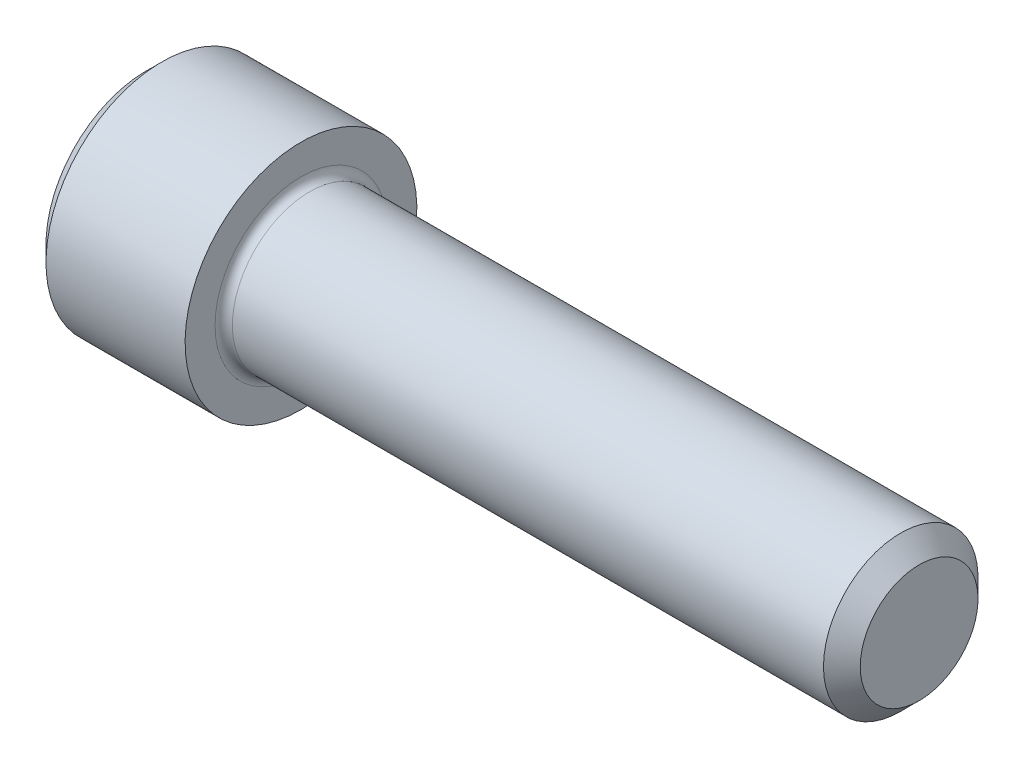
ISO-10303-21;
HEADER;
FILE_DESCRIPTION(('STEP AP214'),'2;1');
FILE_NAME('part.step','',(''),(''),'','','');
FILE_SCHEMA(('AUTOMOTIVE_DESIGN { 1 0 10303 214 1 1 1 1 }'));
ENDSEC;
DATA;
#1=APPLICATION_CONTEXT('core data for automotive mechanical design processes');
#2=APPLICATION_PROTOCOL_DEFINITION('international standard','automotive_design',2000,#1);
#3=PRODUCT_CONTEXT('',#1,'mechanical');
#4=PRODUCT('Part','Part','',(#3));
#5=PRODUCT_RELATED_PRODUCT_CATEGORY('part','',(#4));
#6=PRODUCT_DEFINITION_FORMATION('','',#4);
#7=PRODUCT_DEFINITION_CONTEXT('part definition',#1,'design');
#8=PRODUCT_DEFINITION('design','',#6,#7);
#9=PRODUCT_DEFINITION_SHAPE('','',#8);
#10=(LENGTH_UNIT() NAMED_UNIT(*) SI_UNIT(.MILLI.,.METRE.));
#11=(NAMED_UNIT(*) PLANE_ANGLE_UNIT() SI_UNIT($,.RADIAN.));
#12=(NAMED_UNIT(*) SI_UNIT($,.STERADIAN.) SOLID_ANGLE_UNIT());
#13=UNCERTAINTY_MEASURE_WITH_UNIT(LENGTH_MEASURE(1.E-05),#10,'distance_accuracy_value','');
#14=(GEOMETRIC_REPRESENTATION_CONTEXT(3) GLOBAL_UNCERTAINTY_ASSIGNED_CONTEXT((#13)) GLOBAL_UNIT_ASSIGNED_CONTEXT((#10,
#11,#12)) REPRESENTATION_CONTEXT('',''));
#15=CARTESIAN_POINT('',(0.,0.,0.));
#16=DIRECTION('',(0.,0.,1.));
#17=DIRECTION('',(1.,0.,0.));
#18=AXIS2_PLACEMENT_3D('',#15,#16,#17);
#19=CARTESIAN_POINT('',(3.04800000000005,4.12444598552342,-2.38125000000178));
#20=DIRECTION('',(1.,0.,0.));
#21=DIRECTION('',(0.,1.,0.));
#22=AXIS2_PLACEMENT_3D('',#19,#20,#21);
#23=PLANE('',#22);
#24=DIRECTION('',(0.,1.,0.));
#25=VECTOR('',#24,1.);
#26=CARTESIAN_POINT('',(3.04800000000005,4.12444598552342,2.38125));
#27=LINE('',#26,#25);
#28=CARTESIAN_POINT('',(3.04799999997722,0.,2.38124999995359));
#29=VERTEX_POINT('',#28);
#30=CARTESIAN_POINT('',(3.04800000000005,-1.37481532850781,2.38125));
#31=VERTEX_POINT('',#30);
#32=EDGE_CURVE('E95',#29,#31,#27,.F.);
#33=ORIENTED_EDGE('',*,*,#32,.F.);
#34=CARTESIAN_POINT('',(3.04799999993679,0.,0.));
#35=DIRECTION('',(-1.,0.,0.));
#36=DIRECTION('',(0.,0.,1.));
#37=AXIS2_PLACEMENT_3D('',#34,#35,#36);
#38=CIRCLE('',#37,2.3812499999849);
#39=CARTESIAN_POINT('',(3.04799999996842,-2.0622229927551,1.19062499999625));
#40=VERTEX_POINT('',#39);
#41=EDGE_CURVE('E97',#29,#40,#38,.F.);
#42=ORIENTED_EDGE('',*,*,#41,.T.);
#43=DIRECTION('',(0.,-0.499999999999942,-0.866025403784472));
#44=VECTOR('',#43,1.);
#45=CARTESIAN_POINT('',(3.04800000000005,-1.37481532850781,2.38125));
#46=LINE('',#45,#44);
#47=EDGE_CURVE('E100',#31,#40,#46,.T.);
#48=ORIENTED_EDGE('',*,*,#47,.F.);
#49=EDGE_LOOP('',(#33,#42,#48));
#50=FACE_BOUND('',#49,.T.);
#51=ADVANCED_FACE('F17',(#50),#23,.F.);
#52=CARTESIAN_POINT('',(3.04800000000005,4.12444598552342,-2.38125000000178));
#53=DIRECTION('',(1.,0.,0.));
#54=DIRECTION('',(0.,1.,0.));
#55=AXIS2_PLACEMENT_3D('',#52,#53,#54);
#56=PLANE('',#55);
#57=DIRECTION('',(0.,-0.500000000000063,-0.866025403784402));
#58=VECTOR('',#57,1.);
#59=CARTESIAN_POINT('',(3.04800000000005,-2.0622229927616,1.190625));
#60=LINE('',#59,#58);
#61=CARTESIAN_POINT('',(3.04800000000005,-2.74963065701561,0.));
#62=VERTEX_POINT('',#61);
#63=EDGE_CURVE('E168',#40,#62,#60,.T.);
#64=ORIENTED_EDGE('',*,*,#63,.F.);
#65=CARTESIAN_POINT('',(3.04799999993679,0.,0.));
#66=DIRECTION('',(-1.,0.,0.));
#67=DIRECTION('',(0.,0.,1.));
#68=AXIS2_PLACEMENT_3D('',#65,#66,#67);
#69=CIRCLE('',#68,2.3812499999849);
#70=CARTESIAN_POINT('',(3.04799999996842,-2.0622229927551,-1.19062499999625));
#71=VERTEX_POINT('',#70);
#72=EDGE_CURVE('E115',#40,#71,#69,.F.);
#73=ORIENTED_EDGE('',*,*,#72,.T.);
#74=DIRECTION('',(0.,0.500000000000063,-0.866025403784402));
#75=VECTOR('',#74,1.);
#76=CARTESIAN_POINT('',(3.04800000000005,-2.74963065701561,0.));
#77=LINE('',#76,#75);
#78=EDGE_CURVE('E164',#62,#71,#77,.T.);
#79=ORIENTED_EDGE('',*,*,#78,.F.);
#80=EDGE_LOOP('',(#64,#73,#79));
#81=FACE_BOUND('',#80,.T.);
#82=ADVANCED_FACE('F223',(#81),#56,.F.);
#83=CARTESIAN_POINT('',(3.04800000000005,4.12444598552342,-2.38125000000178));
#84=DIRECTION('',(1.,0.,0.));
#85=DIRECTION('',(0.,1.,0.));
#86=AXIS2_PLACEMENT_3D('',#83,#84,#85);
#87=PLANE('',#86);
#88=DIRECTION('',(0.,0.499999999999942,-0.866025403784472));
#89=VECTOR('',#88,1.);
#90=CARTESIAN_POINT('',(3.04800000000005,-2.0622229927616,-1.190625));
#91=LINE('',#90,#89);
#92=CARTESIAN_POINT('',(3.04800000000005,-1.37481532850781,-2.38125));
#93=VERTEX_POINT('',#92);
#94=EDGE_CURVE('E160',#71,#93,#91,.T.);
#95=ORIENTED_EDGE('',*,*,#94,.F.);
#96=CARTESIAN_POINT('',(3.04799999993679,0.,0.));
#97=DIRECTION('',(-1.,0.,0.));
#98=DIRECTION('',(0.,0.,1.));
#99=AXIS2_PLACEMENT_3D('',#96,#97,#98);
#100=CIRCLE('',#99,2.3812499999849);
#101=CARTESIAN_POINT('',(3.04799999997722,0.,-2.38124999995359));
#102=VERTEX_POINT('',#101);
#103=EDGE_CURVE('E217',#71,#102,#100,.F.);
#104=ORIENTED_EDGE('',*,*,#103,.T.);
#105=DIRECTION('',(0.,1.,0.));
#106=VECTOR('',#105,1.);
#107=CARTESIAN_POINT('',(3.04800000000005,4.12444598552342,-2.38125));
#108=LINE('',#107,#106);
#109=EDGE_CURVE('E156',#93,#102,#108,.T.);
#110=ORIENTED_EDGE('',*,*,#109,.F.);
#111=EDGE_LOOP('',(#95,#104,#110));
#112=FACE_BOUND('',#111,.T.);
#113=ADVANCED_FACE('F226',(#112),#87,.F.);
#114=CARTESIAN_POINT('',(3.04800000000005,4.12444598552342,-2.38125000000178));
#115=DIRECTION('',(1.,0.,0.));
#116=DIRECTION('',(0.,1.,0.));
#117=AXIS2_PLACEMENT_3D('',#114,#115,#116);
#118=PLANE('',#117);
#119=DIRECTION('',(0.,1.,0.));
#120=VECTOR('',#119,1.);
#121=CARTESIAN_POINT('',(3.04800000000005,4.12444598552342,-2.38125));
#122=LINE('',#121,#120);
#123=CARTESIAN_POINT('',(3.04800000000005,1.37481532850806,-2.38125000000015));
#124=VERTEX_POINT('',#123);
#125=EDGE_CURVE('E152',#102,#124,#122,.T.);
#126=ORIENTED_EDGE('',*,*,#125,.F.);
#127=CARTESIAN_POINT('',(3.04799999993679,0.,0.));
#128=DIRECTION('',(-1.,0.,0.));
#129=DIRECTION('',(0.,0.,1.));
#130=AXIS2_PLACEMENT_3D('',#127,#128,#129);
#131=CIRCLE('',#130,2.3812499999849);
#132=CARTESIAN_POINT('',(3.04799999996842,2.0622229927551,-1.19062499999625));
#133=VERTEX_POINT('',#132);
#134=EDGE_CURVE('E214',#102,#133,#131,.F.);
#135=ORIENTED_EDGE('',*,*,#134,.T.);
#136=DIRECTION('',(0.,0.499999999999942,0.866025403784472));
#137=VECTOR('',#136,1.);
#138=CARTESIAN_POINT('',(3.04800000000005,1.37481532850781,-2.38125));
#139=LINE('',#138,#137);
#140=EDGE_CURVE('E148',#124,#133,#139,.T.);
#141=ORIENTED_EDGE('',*,*,#140,.F.);
#142=EDGE_LOOP('',(#126,#135,#141));
#143=FACE_BOUND('',#142,.T.);
#144=ADVANCED_FACE('F234',(#143),#118,.F.);
#145=CARTESIAN_POINT('',(3.04800000000005,4.12444598552342,-2.38125000000178));
#146=DIRECTION('',(1.,0.,0.));
#147=DIRECTION('',(0.,1.,0.));
#148=AXIS2_PLACEMENT_3D('',#145,#146,#147);
#149=PLANE('',#148);
#150=DIRECTION('',(0.,0.500000000000622,0.866025403784079));
#151=VECTOR('',#150,1.);
#152=CARTESIAN_POINT('',(3.04800000000005,2.0622229927616,-1.190625));
#153=LINE('',#152,#151);
#154=CARTESIAN_POINT('',(3.04800000000005,2.74963065701561,-1.77660981990716E-12));
#155=VERTEX_POINT('',#154);
#156=EDGE_CURVE('E144',#133,#155,#153,.T.);
#157=ORIENTED_EDGE('',*,*,#156,.F.);
#158=CARTESIAN_POINT('',(3.04799999993679,0.,0.));
#159=DIRECTION('',(-1.,0.,0.));
#160=DIRECTION('',(0.,0.,1.));
#161=AXIS2_PLACEMENT_3D('',#158,#159,#160);
#162=CIRCLE('',#161,2.3812499999849);
#163=CARTESIAN_POINT('',(3.04799999996842,2.0622229927551,1.19062499999625));
#164=VERTEX_POINT('',#163);
#165=EDGE_CURVE('E123',#133,#164,#162,.F.);
#166=ORIENTED_EDGE('',*,*,#165,.T.);
#167=DIRECTION('',(0.,-0.499999999999503,0.866025403784725));
#168=VECTOR('',#167,1.);
#169=CARTESIAN_POINT('',(3.04800000000005,2.74963065701561,-1.77635683940025E-12));
#170=LINE('',#169,#168);
#171=EDGE_CURVE('E116',#155,#164,#170,.T.);
#172=ORIENTED_EDGE('',*,*,#171,.F.);
#173=EDGE_LOOP('',(#157,#166,#172));
#174=FACE_BOUND('',#173,.T.);
#175=ADVANCED_FACE('F237',(#174),#149,.F.);
#176=CARTESIAN_POINT('',(3.04800000003524,0.,0.));
#177=DIRECTION('',(-1.,0.,0.));
#178=DIRECTION('',(0.,0.,1.));
#179=AXIS2_PLACEMENT_3D('',#176,#177,#178);
#180=CONICAL_SURFACE('',#179,2.38124999981437,1.04719755107977);
#181=CARTESIAN_POINT('',(4.42281532838251,0.,5.6843418860808E-11));
#182=VERTEX_POINT('',#181);
#183=VERTEX_LOOP('',#182);
#184=FACE_BOUND('',#183,.T.);
#185=ORIENTED_EDGE('',*,*,#41,.F.);
#186=CARTESIAN_POINT('',(3.04799999993679,0.,0.));
#187=DIRECTION('',(-1.,0.,0.));
#188=DIRECTION('',(0.,0.,1.));
#189=AXIS2_PLACEMENT_3D('',#186,#187,#188);
#190=CIRCLE('',#189,2.3812499999849);
#191=EDGE_CURVE('E111',#29,#164,#190,.T.);
#192=ORIENTED_EDGE('',*,*,#191,.T.);
#193=ORIENTED_EDGE('',*,*,#165,.F.);
#194=ORIENTED_EDGE('',*,*,#134,.F.);
#195=ORIENTED_EDGE('',*,*,#103,.F.);
#196=ORIENTED_EDGE('',*,*,#72,.F.);
#197=EDGE_LOOP('',(#185,#192,#193,#194,#195,#196));
#198=FACE_BOUND('',#197,.T.);
#199=ADVANCED_FACE('F109',(#184,#198),#180,.F.);
#200=CARTESIAN_POINT('',(3.04800000000005,4.12444598552342,-2.38125000000178));
#201=DIRECTION('',(1.,0.,0.));
#202=DIRECTION('',(0.,1.,0.));
#203=AXIS2_PLACEMENT_3D('',#200,#201,#202);
#204=PLANE('',#203);
#205=DIRECTION('',(0.,0.499999999999998,-0.86602540378444));
#206=VECTOR('',#205,1.);
#207=CARTESIAN_POINT('',(3.04800000000005,2.74963065701561,-1.77635683940025E-12));
#208=LINE('',#207,#206);
#209=CARTESIAN_POINT('',(3.04800000000005,1.37481532850741,2.38124999999988));
#210=VERTEX_POINT('',#209);
#211=EDGE_CURVE('E122',#164,#210,#208,.F.);
#212=ORIENTED_EDGE('',*,*,#211,.F.);
#213=ORIENTED_EDGE('',*,*,#191,.F.);
#214=DIRECTION('',(0.,-1.,0.));
#215=VECTOR('',#214,1.);
#216=CARTESIAN_POINT('',(3.04800000000005,-1.37481532850781,2.38125));
#217=LINE('',#216,#215);
#218=EDGE_CURVE('E120',#29,#210,#217,.F.);
#219=ORIENTED_EDGE('',*,*,#218,.T.);
#220=EDGE_LOOP('',(#212,#213,#219));
#221=FACE_BOUND('',#220,.T.);
#222=ADVANCED_FACE('F119',(#221),#204,.F.);
#223=CARTESIAN_POINT('',(3.04800000000005,2.74963065701561,-1.77635683940025E-12));
#224=DIRECTION('',(0.,-0.86602540378444,-0.499999999999998));
#225=DIRECTION('',(0.,0.499999999999998,-0.86602540378444));
#226=AXIS2_PLACEMENT_3D('',#223,#224,#225);
#227=PLANE('',#226);
#228=ORIENTED_EDGE('',*,*,#211,.T.);
#229=DIRECTION('',(1.,0.,0.));
#230=VECTOR('',#229,1.);
#231=CARTESIAN_POINT('',(3.04800000000005,1.37481532850781,2.38125));
#232=LINE('',#231,#230);
#233=CARTESIAN_POINT('',(0.,1.37481532850743,2.38124999999978));
#234=VERTEX_POINT('',#233);
#235=EDGE_CURVE('E128',#210,#234,#232,.F.);
#236=ORIENTED_EDGE('',*,*,#235,.T.);
#237=DIRECTION('',(0.,-0.499999999999723,0.866025403784599));
#238=VECTOR('',#237,1.);
#239=CARTESIAN_POINT('',(0.,2.74963065701561,-1.77635683940025E-12));
#240=LINE('',#239,#238);
#241=CARTESIAN_POINT('',(0.,2.74963065701561,-1.77644234772968E-12));
#242=VERTEX_POINT('',#241);
#243=EDGE_CURVE('E135',#242,#234,#240,.T.);
#244=ORIENTED_EDGE('',*,*,#243,.F.);
#245=DIRECTION('',(1.,0.,0.));
#246=VECTOR('',#245,1.);
#247=CARTESIAN_POINT('',(3.04800000000005,2.74963065701561,-1.77635683940025E-12));
#248=LINE('',#247,#246);
#249=EDGE_CURVE('E179',#242,#155,#248,.T.);
#250=ORIENTED_EDGE('',*,*,#249,.T.);
#251=ORIENTED_EDGE('',*,*,#171,.T.);
#252=EDGE_LOOP('',(#228,#236,#244,#250,#251));
#253=FACE_BOUND('',#252,.T.);
#254=ADVANCED_FACE('F245',(#253),#227,.T.);
#255=CARTESIAN_POINT('',(3.04800000000005,-1.37481532850781,2.38125));
#256=DIRECTION('',(0.,0.,1.));
#257=DIRECTION('',(0.,-1.,0.));
#258=AXIS2_PLACEMENT_3D('',#255,#256,#257);
#259=PLANE('',#258);
#260=ORIENTED_EDGE('',*,*,#235,.F.);
#261=ORIENTED_EDGE('',*,*,#218,.F.);
#262=ORIENTED_EDGE('',*,*,#32,.T.);
#263=DIRECTION('',(1.,0.,0.));
#264=VECTOR('',#263,1.);
#265=CARTESIAN_POINT('',(3.04800000000005,-1.37481532850781,2.38125));
#266=LINE('',#265,#264);
#267=CARTESIAN_POINT('',(6.52256026967279E-13,-1.37481532850781,2.38125));
#268=VERTEX_POINT('',#267);
#269=EDGE_CURVE('E130',#268,#31,#266,.T.);
#270=ORIENTED_EDGE('',*,*,#269,.F.);
#271=DIRECTION('',(0.,-1.,0.));
#272=VECTOR('',#271,1.);
#273=CARTESIAN_POINT('',(0.,0.,2.38125));
#274=LINE('',#273,#272);
#275=EDGE_CURVE('E249',#234,#268,#274,.T.);
#276=ORIENTED_EDGE('',*,*,#275,.F.);
#277=EDGE_LOOP('',(#260,#261,#262,#270,#276));
#278=FACE_BOUND('',#277,.T.);
#279=ADVANCED_FACE('F126',(#278),#259,.F.);
#280=CARTESIAN_POINT('',(3.04800000000005,-1.37481532850781,2.38125));
#281=DIRECTION('',(0.,0.866025403784438,-0.500000000000001));
#282=DIRECTION('',(0.,0.500000000000001,0.866025403784438));
#283=AXIS2_PLACEMENT_3D('',#280,#281,#282);
#284=PLANE('',#283);
#285=ORIENTED_EDGE('',*,*,#63,.T.);
#286=DIRECTION('',(1.,0.,0.));
#287=VECTOR('',#286,1.);
#288=CARTESIAN_POINT('',(3.04800000000266,-2.74963065701561,0.));
#289=LINE('',#288,#287);
#290=CARTESIAN_POINT('',(1.30451205393456E-12,-2.74963065701561,0.));
#291=VERTEX_POINT('',#290);
#292=EDGE_CURVE('E190',#291,#62,#289,.T.);
#293=ORIENTED_EDGE('',*,*,#292,.F.);
#294=DIRECTION('',(0.,-0.500000000000002,-0.866025403784437));
#295=VECTOR('',#294,1.);
#296=CARTESIAN_POINT('',(0.,-1.37481532850781,2.38125));
#297=LINE('',#296,#295);
#298=EDGE_CURVE('E250',#268,#291,#297,.T.);
#299=ORIENTED_EDGE('',*,*,#298,.F.);
#300=ORIENTED_EDGE('',*,*,#269,.T.);
#301=ORIENTED_EDGE('',*,*,#47,.T.);
#302=EDGE_LOOP('',(#285,#293,#299,#300,#301));
#303=FACE_BOUND('',#302,.T.);
#304=ADVANCED_FACE('F335',(#303),#284,.T.);
#305=CARTESIAN_POINT('',(3.04800000000266,-2.74963065701561,0.));
#306=DIRECTION('',(0.,0.86602540378444,0.499999999999998));
#307=DIRECTION('',(0.,-0.499999999999998,0.86602540378444));
#308=AXIS2_PLACEMENT_3D('',#305,#306,#307);
#309=PLANE('',#308);
#310=ORIENTED_EDGE('',*,*,#94,.T.);
#311=DIRECTION('',(1.,0.,0.));
#312=VECTOR('',#311,1.);
#313=CARTESIAN_POINT('',(3.04800000000005,-1.37481532850781,-2.38125));
#314=LINE('',#313,#312);
#315=CARTESIAN_POINT('',(0.,-1.37481532850781,-2.38125));
#316=VERTEX_POINT('',#315);
#317=EDGE_CURVE('E183',#93,#316,#314,.F.);
#318=ORIENTED_EDGE('',*,*,#317,.T.);
#319=DIRECTION('',(0.,0.500000000000002,-0.866025403784437));
#320=VECTOR('',#319,1.);
#321=CARTESIAN_POINT('',(0.,-2.74963065701561,0.));
#322=LINE('',#321,#320);
#323=EDGE_CURVE('E252',#291,#316,#322,.T.);
#324=ORIENTED_EDGE('',*,*,#323,.F.);
#325=ORIENTED_EDGE('',*,*,#292,.T.);
#326=ORIENTED_EDGE('',*,*,#78,.T.);
#327=EDGE_LOOP('',(#310,#318,#324,#325,#326));
#328=FACE_BOUND('',#327,.T.);
#329=ADVANCED_FACE('F331',(#328),#309,.T.);
#330=CARTESIAN_POINT('',(3.04800000000005,1.37481532850781,-2.38125));
#331=DIRECTION('',(0.,0.,-1.));
#332=DIRECTION('',(0.,1.,0.));
#333=AXIS2_PLACEMENT_3D('',#330,#331,#332);
#334=PLANE('',#333);
#335=ORIENTED_EDGE('',*,*,#317,.F.);
#336=ORIENTED_EDGE('',*,*,#109,.T.);
#337=ORIENTED_EDGE('',*,*,#125,.T.);
#338=DIRECTION('',(1.,0.,0.));
#339=VECTOR('',#338,1.);
#340=CARTESIAN_POINT('',(3.04800000000005,1.37481532850858,-2.38125000000045));
#341=LINE('',#340,#339);
#342=CARTESIAN_POINT('',(0.,1.374815328508,-2.38125000000011));
#343=VERTEX_POINT('',#342);
#344=EDGE_CURVE('E182',#124,#343,#341,.F.);
#345=ORIENTED_EDGE('',*,*,#344,.T.);
#346=DIRECTION('',(0.,-1.,0.));
#347=VECTOR('',#346,1.);
#348=CARTESIAN_POINT('',(0.,0.,-2.38125));
#349=LINE('',#348,#347);
#350=EDGE_CURVE('E257',#316,#343,#349,.F.);
#351=ORIENTED_EDGE('',*,*,#350,.F.);
#352=EDGE_LOOP('',(#335,#336,#337,#345,#351));
#353=FACE_BOUND('',#352,.T.);
#354=ADVANCED_FACE('F328',(#353),#334,.F.);
#355=CARTESIAN_POINT('',(3.04800000000005,2.74963065701561,-1.77635683940025E-12));
#356=DIRECTION('',(0.,0.866025403784438,-0.500000000000001));
#357=DIRECTION('',(0.,0.500000000000001,0.866025403784438));
#358=AXIS2_PLACEMENT_3D('',#355,#356,#357);
#359=PLANE('',#358);
#360=ORIENTED_EDGE('',*,*,#344,.F.);
#361=ORIENTED_EDGE('',*,*,#140,.T.);
#362=ORIENTED_EDGE('',*,*,#156,.T.);
#363=ORIENTED_EDGE('',*,*,#249,.F.);
#364=DIRECTION('',(0.,0.500000000000282,0.866025403784276));
#365=VECTOR('',#364,1.);
#366=CARTESIAN_POINT('',(0.,1.37481532850781,-2.38125));
#367=LINE('',#366,#365);
#368=EDGE_CURVE('E210',#343,#242,#367,.T.);
#369=ORIENTED_EDGE('',*,*,#368,.F.);
#370=EDGE_LOOP('',(#360,#361,#362,#363,#369));
#371=FACE_BOUND('',#370,.T.);
#372=ADVANCED_FACE('F241',(#371),#359,.F.);
#373=CARTESIAN_POINT('',(0.,0.,0.));
#374=DIRECTION('',(-1.,0.,0.));
#375=DIRECTION('',(0.,-1.,0.));
#376=AXIS2_PLACEMENT_3D('',#373,#374,#375);
#377=PLANE('',#376);
#378=CARTESIAN_POINT('',(0.,0.,0.));
#379=DIRECTION('',(1.,0.,0.));
#380=DIRECTION('',(0.,0.,-1.));
#381=AXIS2_PLACEMENT_3D('',#378,#379,#380);
#382=CIRCLE('',#381,4.1275000000951);
#383=CARTESIAN_POINT('',(0.,0.,-4.1275000000951));
#384=VERTEX_POINT('',#383);
#385=EDGE_CURVE('E207',#384,#384,#382,.T.);
#386=ORIENTED_EDGE('',*,*,#385,.F.);
#387=EDGE_LOOP('',(#386));
#388=FACE_BOUND('',#387,.T.);
#389=ORIENTED_EDGE('',*,*,#350,.T.);
#390=ORIENTED_EDGE('',*,*,#368,.T.);
#391=ORIENTED_EDGE('',*,*,#243,.T.);
#392=ORIENTED_EDGE('',*,*,#275,.T.);
#393=ORIENTED_EDGE('',*,*,#298,.T.);
#394=ORIENTED_EDGE('',*,*,#323,.T.);
#395=EDGE_LOOP('',(#389,#390,#391,#392,#393,#394));
#396=FACE_BOUND('',#395,.T.);
#397=ADVANCED_FACE('F321',(#388,#396),#377,.T.);
#398=CARTESIAN_POINT('',(0.634999999874708,0.,0.));
#399=DIRECTION('',(1.,0.,0.));
#400=DIRECTION('',(0.,0.,-1.));
#401=AXIS2_PLACEMENT_3D('',#398,#399,#400);
#402=CONICAL_SURFACE('',#401,4.7624999999698,0.785398163397448);
#403=ORIENTED_EDGE('',*,*,#385,.T.);
#404=EDGE_LOOP('',(#403));
#405=FACE_BOUND('',#404,.T.);
#406=CARTESIAN_POINT('',(0.635000000000052,0.,0.));
#407=DIRECTION('',(-1.,0.,0.));
#408=DIRECTION('',(0.,-1.,0.));
#409=AXIS2_PLACEMENT_3D('',#406,#407,#408);
#410=CIRCLE('',#409,4.7625);
#411=CARTESIAN_POINT('',(0.635000000000052,-4.7625,0.));
#412=VERTEX_POINT('',#411);
#413=EDGE_CURVE('E209',#412,#412,#410,.F.);
#414=ORIENTED_EDGE('',*,*,#413,.F.);
#415=EDGE_LOOP('',(#414));
#416=FACE_BOUND('',#415,.T.);
#417=ADVANCED_FACE('F317',(#405,#416),#402,.T.);
#418=CARTESIAN_POINT('',(-31.7499999999999,0.,0.));
#419=DIRECTION('',(-1.,0.,0.));
#420=DIRECTION('',(0.,-1.,0.));
#421=AXIS2_PLACEMENT_3D('',#418,#419,#420);
#422=CYLINDRICAL_SURFACE('',#421,4.7625);
#423=CARTESIAN_POINT('',(6.34999999999997,0.,0.));
#424=DIRECTION('',(-1.,0.,0.));
#425=DIRECTION('',(0.,-1.,0.));
#426=AXIS2_PLACEMENT_3D('',#423,#424,#425);
#427=CIRCLE('',#426,4.7625);
#428=CARTESIAN_POINT('',(6.34999999999997,-4.7625,0.));
#429=VERTEX_POINT('',#428);
#430=EDGE_CURVE('E204',#429,#429,#427,.F.);
#431=ORIENTED_EDGE('',*,*,#430,.F.);
#432=EDGE_LOOP('',(#431));
#433=FACE_BOUND('',#432,.T.);
#434=ORIENTED_EDGE('',*,*,#413,.T.);
#435=EDGE_LOOP('',(#434));
#436=FACE_BOUND('',#435,.T.);
#437=ADVANCED_FACE('F313',(#433,#436),#422,.T.);
#438=CARTESIAN_POINT('',(31.7499999999999,2.41935000000881,0.));
#439=DIRECTION('',(1.,0.,0.));
#440=DIRECTION('',(0.,1.,0.));
#441=AXIS2_PLACEMENT_3D('',#438,#439,#440);
#442=PLANE('',#441);
#443=CARTESIAN_POINT('',(31.750000000045,8.77076189453874E-12,0.));
#444=DIRECTION('',(-1.,0.,0.));
#445=DIRECTION('',(0.,0.,1.));
#446=AXIS2_PLACEMENT_3D('',#443,#444,#445);
#447=CIRCLE('',#446,2.41934999996829);
#448=CARTESIAN_POINT('',(31.750000000045,8.77076189453874E-12,2.41934999996829));
#449=VERTEX_POINT('',#448);
#450=EDGE_CURVE('E200',#449,#449,#447,.T.);
#451=ORIENTED_EDGE('',*,*,#450,.F.);
#452=EDGE_LOOP('',(#451));
#453=FACE_BOUND('',#452,.T.);
#454=ADVANCED_FACE('F301',(#453),#442,.T.);
#455=CARTESIAN_POINT('',(6.34999999999997,4.76250000000877,-1.77635683940025E-12));
#456=DIRECTION('',(1.,0.,0.));
#457=DIRECTION('',(0.,1.,0.));
#458=AXIS2_PLACEMENT_3D('',#455,#456,#457);
#459=PLANE('',#458);
#460=ORIENTED_EDGE('',*,*,#430,.T.);
#461=EDGE_LOOP('',(#460));
#462=FACE_BOUND('',#461,.T.);
#463=CARTESIAN_POINT('',(6.34999999999998,8.77076189453874E-12,0.));
#464=DIRECTION('',(1.,0.,0.));
#465=DIRECTION('',(0.,0.,1.));
#466=AXIS2_PLACEMENT_3D('',#463,#464,#465);
#467=CIRCLE('',#466,3.53059999999999);
#468=CARTESIAN_POINT('',(6.34999999999997,8.77076189453874E-12,-3.53059999999999));
#469=VERTEX_POINT('',#468);
#470=CARTESIAN_POINT('',(6.34999999999997,4.87039630472094E-12,3.53059999999999));
#471=VERTEX_POINT('',#470);
#472=EDGE_CURVE('E203',#469,#471,#467,.F.);
#473=ORIENTED_EDGE('',*,*,#472,.T.);
#474=CARTESIAN_POINT('',(6.34999999999998,8.77076189453874E-12,0.));
#475=DIRECTION('',(1.,0.,0.));
#476=DIRECTION('',(0.,0.,-1.));
#477=AXIS2_PLACEMENT_3D('',#474,#475,#476);
#478=CIRCLE('',#477,3.53059999999999);
#479=EDGE_CURVE('E36',#471,#469,#478,.F.);
#480=ORIENTED_EDGE('',*,*,#479,.T.);
#481=EDGE_LOOP('',(#473,#480));
#482=FACE_BOUND('',#481,.T.);
#483=ADVANCED_FACE('F292',(#462,#482),#459,.T.);
#484=CARTESIAN_POINT('',(30.9943500000713,8.77076189453874E-12,0.));
#485=DIRECTION('',(-1.,0.,0.));
#486=DIRECTION('',(0.,0.,1.));
#487=AXIS2_PLACEMENT_3D('',#484,#485,#486);
#488=CONICAL_SURFACE('',#487,3.17499999994197,0.785398163397448);
#489=ORIENTED_EDGE('',*,*,#450,.T.);
#490=EDGE_LOOP('',(#489));
#491=FACE_BOUND('',#490,.T.);
#492=CARTESIAN_POINT('',(30.9943499999999,0.,0.));
#493=DIRECTION('',(-1.,0.,0.));
#494=DIRECTION('',(0.,-1.,0.));
#495=AXIS2_PLACEMENT_3D('',#492,#493,#494);
#496=CIRCLE('',#495,3.17499999999999);
#497=CARTESIAN_POINT('',(30.9943499999999,-3.17499999999999,0.));
#498=VERTEX_POINT('',#497);
#499=EDGE_CURVE('E28',#498,#498,#496,.T.);
#500=ORIENTED_EDGE('',*,*,#499,.F.);
#501=EDGE_LOOP('',(#500));
#502=FACE_BOUND('',#501,.T.);
#503=ADVANCED_FACE('F281',(#491,#502),#488,.T.);
#504=CARTESIAN_POINT('',(6.70559999999998,8.77076189453874E-12,0.));
#505=DIRECTION('',(1.,0.,0.));
#506=DIRECTION('',(0.,0.,-1.));
#507=AXIS2_PLACEMENT_3D('',#504,#505,#506);
#508=TOROIDAL_SURFACE('',#507,3.53059999999999,0.3556);
#509=CARTESIAN_POINT('',(6.70559999999998,0.,0.));
#510=DIRECTION('',(-1.,0.,0.));
#511=DIRECTION('',(0.,-1.,0.));
#512=AXIS2_PLACEMENT_3D('',#509,#510,#511);
#513=CIRCLE('',#512,3.17499999999999);
#514=CARTESIAN_POINT('',(6.70559999999998,-3.17499999999999,0.));
#515=VERTEX_POINT('',#514);
#516=EDGE_CURVE('E11',#515,#515,#513,.F.);
#517=ORIENTED_EDGE('',*,*,#516,.F.);
#518=EDGE_LOOP('',(#517));
#519=FACE_BOUND('',#518,.T.);
#520=ORIENTED_EDGE('',*,*,#472,.F.);
#521=ORIENTED_EDGE('',*,*,#479,.F.);
#522=EDGE_LOOP('',(#520,#521));
#523=FACE_BOUND('',#522,.T.);
#524=ADVANCED_FACE('F269',(#519,#523),#508,.F.);
#525=CARTESIAN_POINT('',(-31.7499999999999,0.,0.));
#526=DIRECTION('',(-1.,0.,0.));
#527=DIRECTION('',(0.,-1.,0.));
#528=AXIS2_PLACEMENT_3D('',#525,#526,#527);
#529=CYLINDRICAL_SURFACE('',#528,3.17499999999999);
#530=ORIENTED_EDGE('',*,*,#499,.T.);
#531=EDGE_LOOP('',(#530));
#532=FACE_BOUND('',#531,.T.);
#533=ORIENTED_EDGE('',*,*,#516,.T.);
#534=EDGE_LOOP('',(#533));
#535=FACE_BOUND('',#534,.T.);
#536=ADVANCED_FACE('F280',(#532,#535),#529,.T.);
#537=CLOSED_SHELL('',(#51,#82,#113,#144,#175,#199,#222,#254,#279,#304,#329,#354,#372,#397,#417,
#437,#454,#483,#503,#524,#536));
#538=MANIFOLD_SOLID_BREP('B1',#537);
#539=ADVANCED_BREP_SHAPE_REPRESENTATION('',(#18,#538),#14);
#540=SHAPE_DEFINITION_REPRESENTATION(#9,#539);
ENDSEC;
END-ISO-10303-21;
